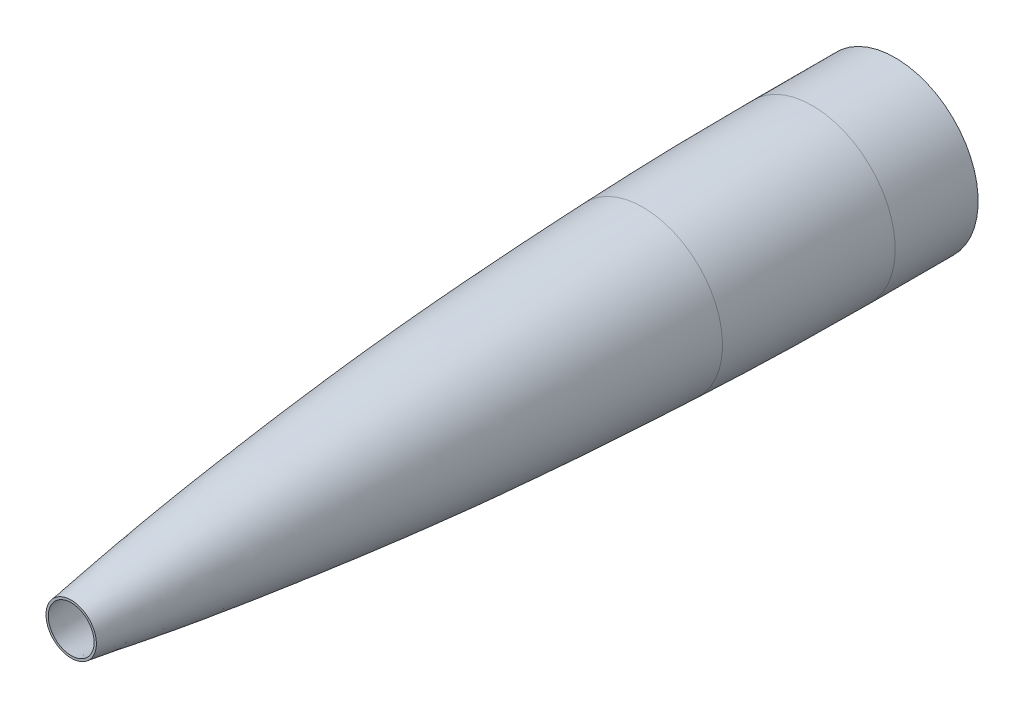
ISO-10303-21;
HEADER;
FILE_DESCRIPTION(('STEP AP214'),'2;1');
FILE_NAME('part.step','',(''),(''),'','','');
FILE_SCHEMA(('AUTOMOTIVE_DESIGN { 1 0 10303 214 1 1 1 1 }'));
ENDSEC;
DATA;
#1=APPLICATION_CONTEXT('core data for automotive mechanical design processes');
#2=APPLICATION_PROTOCOL_DEFINITION('international standard','automotive_design',2000,#1);
#3=PRODUCT_CONTEXT('',#1,'mechanical');
#4=PRODUCT('Part','Part','',(#3));
#5=PRODUCT_RELATED_PRODUCT_CATEGORY('part','',(#4));
#6=PRODUCT_DEFINITION_FORMATION('','',#4);
#7=PRODUCT_DEFINITION_CONTEXT('part definition',#1,'design');
#8=PRODUCT_DEFINITION('design','',#6,#7);
#9=PRODUCT_DEFINITION_SHAPE('','',#8);
#10=(LENGTH_UNIT() NAMED_UNIT(*) SI_UNIT(.MILLI.,.METRE.));
#11=(NAMED_UNIT(*) PLANE_ANGLE_UNIT() SI_UNIT($,.RADIAN.));
#12=(NAMED_UNIT(*) SI_UNIT($,.STERADIAN.) SOLID_ANGLE_UNIT());
#13=UNCERTAINTY_MEASURE_WITH_UNIT(LENGTH_MEASURE(1.E-05),#10,'distance_accuracy_value','');
#14=(GEOMETRIC_REPRESENTATION_CONTEXT(3) GLOBAL_UNCERTAINTY_ASSIGNED_CONTEXT((#13)) GLOBAL_UNIT_ASSIGNED_CONTEXT((#10,
#11,#12)) REPRESENTATION_CONTEXT('',''));
#15=CARTESIAN_POINT('',(0.,0.,0.));
#16=DIRECTION('',(0.,0.,1.));
#17=DIRECTION('',(1.,0.,0.));
#18=AXIS2_PLACEMENT_3D('',#15,#16,#17);
#19=CARTESIAN_POINT('',(0.,0.,0.));
#20=DIRECTION('',(0.,0.,1.));
#21=DIRECTION('',(1.,0.,0.));
#22=AXIS2_PLACEMENT_3D('',#19,#20,#21);
#23=PLANE('',#22);
#24=CARTESIAN_POINT('',(0.,0.,0.));
#25=DIRECTION('',(0.,0.,-1.));
#26=DIRECTION('',(-1.,0.,0.));
#27=AXIS2_PLACEMENT_3D('',#24,#25,#26);
#28=CIRCLE('',#27,21.9492765941224);
#29=CARTESIAN_POINT('',(-21.9492765941224,0.,0.));
#30=VERTEX_POINT('',#29);
#31=EDGE_CURVE('E52',#30,#30,#28,.T.);
#32=ORIENTED_EDGE('',*,*,#31,.T.);
#33=EDGE_LOOP('',(#32));
#34=FACE_BOUND('',#33,.T.);
#35=CARTESIAN_POINT('',(0.,0.,0.));
#36=DIRECTION('',(0.,0.,-1.));
#37=DIRECTION('',(-1.,0.,0.));
#38=AXIS2_PLACEMENT_3D('',#35,#36,#37);
#39=CIRCLE('',#38,24.1300000004652);
#40=CARTESIAN_POINT('',(-24.1300000004652,0.,0.));
#41=VERTEX_POINT('',#40);
#42=EDGE_CURVE('E10',#41,#41,#39,.T.);
#43=ORIENTED_EDGE('',*,*,#42,.F.);
#44=EDGE_LOOP('',(#43));
#45=FACE_BOUND('',#44,.T.);
#46=ADVANCED_FACE('F40',(#34,#45),#23,.T.);
#47=CARTESIAN_POINT('',(23.6093000006736,0.,3.66138359766256));
#48=CARTESIAN_POINT('',(23.713440000663,0.,2.92910687791197));
#49=CARTESIAN_POINT('',(23.8175800006523,0.,2.19683015816137));
#50=CARTESIAN_POINT('',(23.9217200006416,0.,1.46455343841078));
#51=CARTESIAN_POINT('',(24.0258600006309,0.,0.73227671866018));
#52=CARTESIAN_POINT('',(24.1300000006202,0.,-1.09041595197645E-09));
#53=CARTESIAN_POINT('',(34.5439999995525,0.,-73.22767197615));
#54=CARTESIAN_POINT('',(44.9579999977144,0.,-112.391094168987));
#55=CARTESIAN_POINT('',(55.3719999985113,0.,-268.074012876022));
#56=CARTESIAN_POINT('',(65.7859999960907,0.,-281.481829661402));
#57=CARTESIAN_POINT('',(76.1999999993788,0.,-547.325214573675));
#58=B_SPLINE_CURVE_WITH_KNOTS('',5,(#47,#48,#49,#50,#51,#52,#53,#54,#55,#56,#57),.UNSPECIFIED.,
.F.,.F.,(6,5,6),(0.0790522202796356,0.0878358002843633,0.966193800757135),.UNSPECIFIED.);
#59=CARTESIAN_POINT('',(1.74175377047759E-12,0.,-788.90114));
#60=DIRECTION('',(0.,0.,-1.));
#61=AXIS1_PLACEMENT('',#59,#60);
#62=SURFACE_OF_REVOLUTION('',#58,#61);
#63=CARTESIAN_POINT('',(1.20839698135311E-12,0.,-547.325214574175));
#64=DIRECTION('',(0.,0.,-1.));
#65=DIRECTION('',(-1.,0.,0.));
#66=AXIS2_PLACEMENT_3D('',#63,#64,#65);
#67=CIRCLE('',#66,76.1999999994162);
#68=CARTESIAN_POINT('',(-76.199999999415,0.,-547.325214574175));
#69=VERTEX_POINT('',#68);
#70=EDGE_CURVE('E47',#69,#69,#67,.T.);
#71=ORIENTED_EDGE('',*,*,#70,.F.);
#72=EDGE_LOOP('',(#71));
#73=FACE_BOUND('',#72,.T.);
#74=ORIENTED_EDGE('',*,*,#42,.T.);
#75=EDGE_LOOP('',(#74));
#76=FACE_BOUND('',#75,.T.);
#77=ADVANCED_FACE('F69',(#73,#76),#62,.T.);
#78=CARTESIAN_POINT('',(1.11774806950198E-12,0.,-788.90114));
#79=DIRECTION('',(0.,0.,1.));
#80=DIRECTION('',(1.,0.,0.));
#81=AXIS2_PLACEMENT_3D('',#78,#79,#80);
#82=PLANE('',#81);
#83=CARTESIAN_POINT('',(1.74175377047759E-12,0.,-788.90114));
#84=DIRECTION('',(0.,0.,1.));
#85=DIRECTION('',(1.,0.,0.));
#86=AXIS2_PLACEMENT_3D('',#83,#84,#85);
#87=CIRCLE('',#86,76.1999999999983);
#88=CARTESIAN_POINT('',(76.2000000000001,0.,-788.90114));
#89=VERTEX_POINT('',#88);
#90=EDGE_CURVE('E64',#89,#89,#87,.F.);
#91=ORIENTED_EDGE('',*,*,#90,.F.);
#92=EDGE_LOOP('',(#91));
#93=FACE_BOUND('',#92,.T.);
#94=CARTESIAN_POINT('',(1.74175377047759E-12,0.,-788.90114));
#95=DIRECTION('',(0.,0.,-1.));
#96=DIRECTION('',(-1.,0.,0.));
#97=AXIS2_PLACEMENT_3D('',#94,#95,#96);
#98=CIRCLE('',#97,79.374999999998);
#99=CARTESIAN_POINT('',(-79.3749999999962,0.,-788.90114));
#100=VERTEX_POINT('',#99);
#101=EDGE_CURVE('E153',#100,#100,#98,.T.);
#102=ORIENTED_EDGE('',*,*,#101,.T.);
#103=EDGE_LOOP('',(#102));
#104=FACE_BOUND('',#103,.T.);
#105=ADVANCED_FACE('F74',(#93,#104),#82,.F.);
#106=CARTESIAN_POINT('',(23.6093000006736,0.,3.66138359766256));
#107=CARTESIAN_POINT('',(23.713440000663,0.,2.92910687791197));
#108=CARTESIAN_POINT('',(23.8175800006523,0.,2.19683015816137));
#109=CARTESIAN_POINT('',(23.9217200006416,0.,1.46455343841078));
#110=CARTESIAN_POINT('',(24.0258600006309,0.,0.73227671866018));
#111=CARTESIAN_POINT('',(34.5439999995525,0.,-73.22767197615));
#112=CARTESIAN_POINT('',(44.9579999977144,0.,-112.391094168987));
#113=CARTESIAN_POINT('',(55.3719999985113,0.,-268.074012876022));
#114=CARTESIAN_POINT('',(65.7859999960907,0.,-281.481829661402));
#115=CARTESIAN_POINT('',(76.1999999993788,0.,-547.325214573675));
#116=B_SPLINE_CURVE_WITH_KNOTS('',5,(#106,#107,#108,#109,#110,#111,#112,#113,#114,#115),
.UNSPECIFIED.,.F.,.F.,(6,4,6),(0.0790522202796356,0.0878358002843633,0.966193800757135),.UNSPECIFIED.);
#117=CARTESIAN_POINT('',(1.74175377047759E-12,0.,-788.90114));
#118=DIRECTION('',(0.,0.,-1.));
#119=AXIS1_PLACEMENT('',#117,#118);
#120=SURFACE_OF_REVOLUTION('',#116,#119);
#121=OFFSET_SURFACE('',#120,-2.159,.F.);
#122=CARTESIAN_POINT('',(1.08899757895277E-12,0.,-547.409725213669));
#123=DIRECTION('',(0.,0.,-1.));
#124=DIRECTION('',(-1.,0.,0.));
#125=AXIS2_PLACEMENT_3D('',#122,#123,#124);
#126=CIRCLE('',#125,74.0426546511213);
#127=CARTESIAN_POINT('',(-74.0426546511202,0.,-547.409725213669));
#128=VERTEX_POINT('',#127);
#129=EDGE_CURVE('E57',#128,#128,#126,.T.);
#130=ORIENTED_EDGE('',*,*,#129,.T.);
#131=EDGE_LOOP('',(#130));
#132=FACE_BOUND('',#131,.T.);
#133=ORIENTED_EDGE('',*,*,#31,.F.);
#134=EDGE_LOOP('',(#133));
#135=FACE_BOUND('',#134,.T.);
#136=ADVANCED_FACE('F76',(#132,#135),#121,.F.);
#137=CARTESIAN_POINT('',(1.33226762955019E-12,0.,-657.595231051004));
#138=DIRECTION('',(0.,0.,-1.));
#139=DIRECTION('',(-1.,0.,0.));
#140=AXIS2_PLACEMENT_3D('',#137,#138,#139);
#141=DEGENERATE_TOROIDAL_SURFACE('',#140,2738.71784379868,2814.91784379868,.F.);
#142=CARTESIAN_POINT('',(1.45185361645082E-12,0.,-657.595231051011));
#143=DIRECTION('',(0.,0.,-1.));
#144=DIRECTION('',(-1.,0.,0.));
#145=AXIS2_PLACEMENT_3D('',#142,#143,#144);
#146=CIRCLE('',#145,76.1999999999983);
#147=CARTESIAN_POINT('',(-76.1999999999969,0.,-657.595231051011));
#148=VERTEX_POINT('',#147);
#149=EDGE_CURVE('E162',#148,#148,#146,.T.);
#150=ORIENTED_EDGE('',*,*,#149,.T.);
#151=EDGE_LOOP('',(#150));
#152=FACE_BOUND('',#151,.T.);
#153=ORIENTED_EDGE('',*,*,#129,.F.);
#154=EDGE_LOOP('',(#153));
#155=FACE_BOUND('',#154,.T.);
#156=ADVANCED_FACE('F78',(#152,#155),#141,.T.);
#157=CARTESIAN_POINT('',(1.74175377047759E-12,0.,-788.90114));
#158=DIRECTION('',(0.,0.,-1.));
#159=DIRECTION('',(-1.,0.,0.));
#160=AXIS2_PLACEMENT_3D('',#157,#158,#159);
#161=CYLINDRICAL_SURFACE('',#160,76.1999999999983);
#162=ORIENTED_EDGE('',*,*,#90,.T.);
#163=EDGE_LOOP('',(#162));
#164=FACE_BOUND('',#163,.T.);
#165=ORIENTED_EDGE('',*,*,#149,.F.);
#166=EDGE_LOOP('',(#165));
#167=FACE_BOUND('',#166,.T.);
#168=ADVANCED_FACE('F81',(#164,#167),#161,.F.);
#169=CARTESIAN_POINT('',(1.77635683940025E-12,0.,-709.48700349673));
#170=DIRECTION('',(0.,0.,-1.));
#171=DIRECTION('',(-1.,0.,0.));
#172=AXIS2_PLACEMENT_3D('',#169,#170,#171);
#173=DEGENERATE_TOROIDAL_SURFACE('',#172,4063.38506402266,4142.76006402266,.F.);
#174=CARTESIAN_POINT('',(1.56642144470129E-12,0.,-709.48700349674));
#175=DIRECTION('',(0.,0.,-1.));
#176=DIRECTION('',(-1.,0.,0.));
#177=AXIS2_PLACEMENT_3D('',#174,#175,#176);
#178=CIRCLE('',#177,79.3749999999982);
#179=CARTESIAN_POINT('',(-79.3749999999966,0.,-709.48700349674));
#180=VERTEX_POINT('',#179);
#181=EDGE_CURVE('E156',#180,#180,#178,.T.);
#182=ORIENTED_EDGE('',*,*,#181,.F.);
#183=EDGE_LOOP('',(#182));
#184=FACE_BOUND('',#183,.T.);
#185=ORIENTED_EDGE('',*,*,#70,.T.);
#186=EDGE_LOOP('',(#185));
#187=FACE_BOUND('',#186,.T.);
#188=ADVANCED_FACE('F84',(#184,#187),#173,.F.);
#189=CARTESIAN_POINT('',(1.74175377047759E-12,0.,-788.90114));
#190=DIRECTION('',(0.,0.,-1.));
#191=DIRECTION('',(-1.,0.,0.));
#192=AXIS2_PLACEMENT_3D('',#189,#190,#191);
#193=CYLINDRICAL_SURFACE('',#192,79.3749999999981);
#194=ORIENTED_EDGE('',*,*,#101,.F.);
#195=EDGE_LOOP('',(#194));
#196=FACE_BOUND('',#195,.T.);
#197=ORIENTED_EDGE('',*,*,#181,.T.);
#198=EDGE_LOOP('',(#197));
#199=FACE_BOUND('',#198,.T.);
#200=ADVANCED_FACE('F137',(#196,#199),#193,.T.);
#201=CLOSED_SHELL('',(#46,#77,#105,#136,#156,#168,#188,#200));
#202=MANIFOLD_SOLID_BREP('B2',#201);
#203=ADVANCED_BREP_SHAPE_REPRESENTATION('',(#18,#202),#14);
#204=SHAPE_DEFINITION_REPRESENTATION(#9,#203);
ENDSEC;
END-ISO-10303-21;
